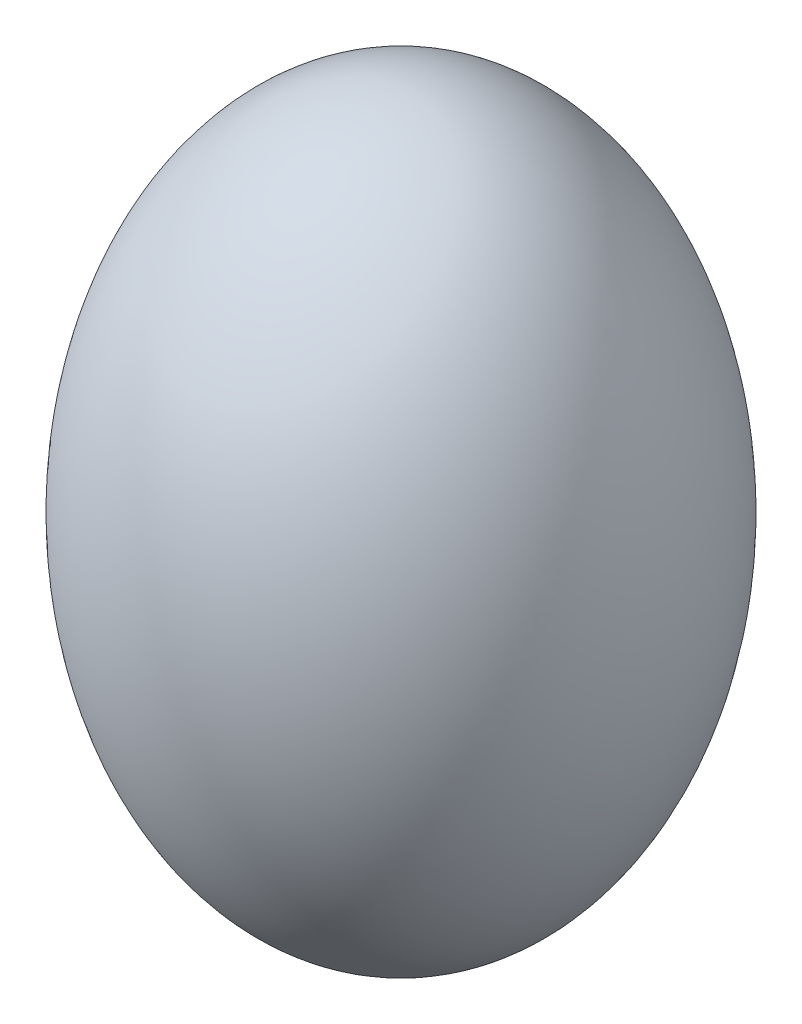
ISO-10303-21;
HEADER;
FILE_DESCRIPTION(('STEP AP214'),'2;1');
FILE_NAME('part.step','',(''),(''),'','','');
FILE_SCHEMA(('AUTOMOTIVE_DESIGN { 1 0 10303 214 1 1 1 1 }'));
ENDSEC;
DATA;
#1=APPLICATION_CONTEXT('core data for automotive mechanical design processes');
#2=APPLICATION_PROTOCOL_DEFINITION('international standard','automotive_design',2000,#1);
#3=PRODUCT_CONTEXT('',#1,'mechanical');
#4=PRODUCT('Part','Part','',(#3));
#5=PRODUCT_RELATED_PRODUCT_CATEGORY('part','',(#4));
#6=PRODUCT_DEFINITION_FORMATION('','',#4);
#7=PRODUCT_DEFINITION_CONTEXT('part definition',#1,'design');
#8=PRODUCT_DEFINITION('design','',#6,#7);
#9=PRODUCT_DEFINITION_SHAPE('','',#8);
#10=(LENGTH_UNIT() NAMED_UNIT(*) SI_UNIT(.MILLI.,.METRE.));
#11=(NAMED_UNIT(*) PLANE_ANGLE_UNIT() SI_UNIT($,.RADIAN.));
#12=(NAMED_UNIT(*) SI_UNIT($,.STERADIAN.) SOLID_ANGLE_UNIT());
#13=UNCERTAINTY_MEASURE_WITH_UNIT(LENGTH_MEASURE(1.E-05),#10,'distance_accuracy_value','');
#14=(GEOMETRIC_REPRESENTATION_CONTEXT(3) GLOBAL_UNCERTAINTY_ASSIGNED_CONTEXT((#13)) GLOBAL_UNIT_ASSIGNED_CONTEXT((#10,
#11,#12)) REPRESENTATION_CONTEXT('',''));
#15=CARTESIAN_POINT('',(0.,0.,0.));
#16=DIRECTION('',(0.,0.,1.));
#17=DIRECTION('',(1.,0.,0.));
#18=AXIS2_PLACEMENT_3D('',#15,#16,#17);
#19=CARTESIAN_POINT('',(0.,0.,0.));
#20=DIRECTION('',(0.,0.,1.));
#21=DIRECTION('',(0.,1.,0.));
#22=AXIS2_PLACEMENT_3D('',#19,#20,#21);
#23=ELLIPSE('',#22,32.5,22.5);
#24=TRIMMED_CURVE('',#23,(PARAMETER_VALUE(0.)),(PARAMETER_VALUE(3.14159265358979)),.T.,.PARAMETER.);
#25=CARTESIAN_POINT('',(0.,80.2354199683043,0.));
#26=DIRECTION('',(0.,1.,0.));
#27=AXIS1_PLACEMENT('',#25,#26);
#28=SURFACE_OF_REVOLUTION('',#24,#27);
#29=CARTESIAN_POINT('',(0.,-32.5,0.));
#30=VERTEX_POINT('',#29);
#31=VERTEX_LOOP('',#30);
#32=FACE_BOUND('',#31,.T.);
#33=CARTESIAN_POINT('',(0.,32.5,0.));
#34=VERTEX_POINT('',#33);
#35=VERTEX_LOOP('',#34);
#36=FACE_BOUND('',#35,.T.);
#37=ADVANCED_FACE('F31',(#32,#36),#28,.F.);
#38=CLOSED_SHELL('',(#37));
#39=MANIFOLD_SOLID_BREP('B2',#38);
#40=ADVANCED_BREP_SHAPE_REPRESENTATION('',(#18,#39),#14);
#41=SHAPE_DEFINITION_REPRESENTATION(#9,#40);
ENDSEC;
END-ISO-10303-21;
